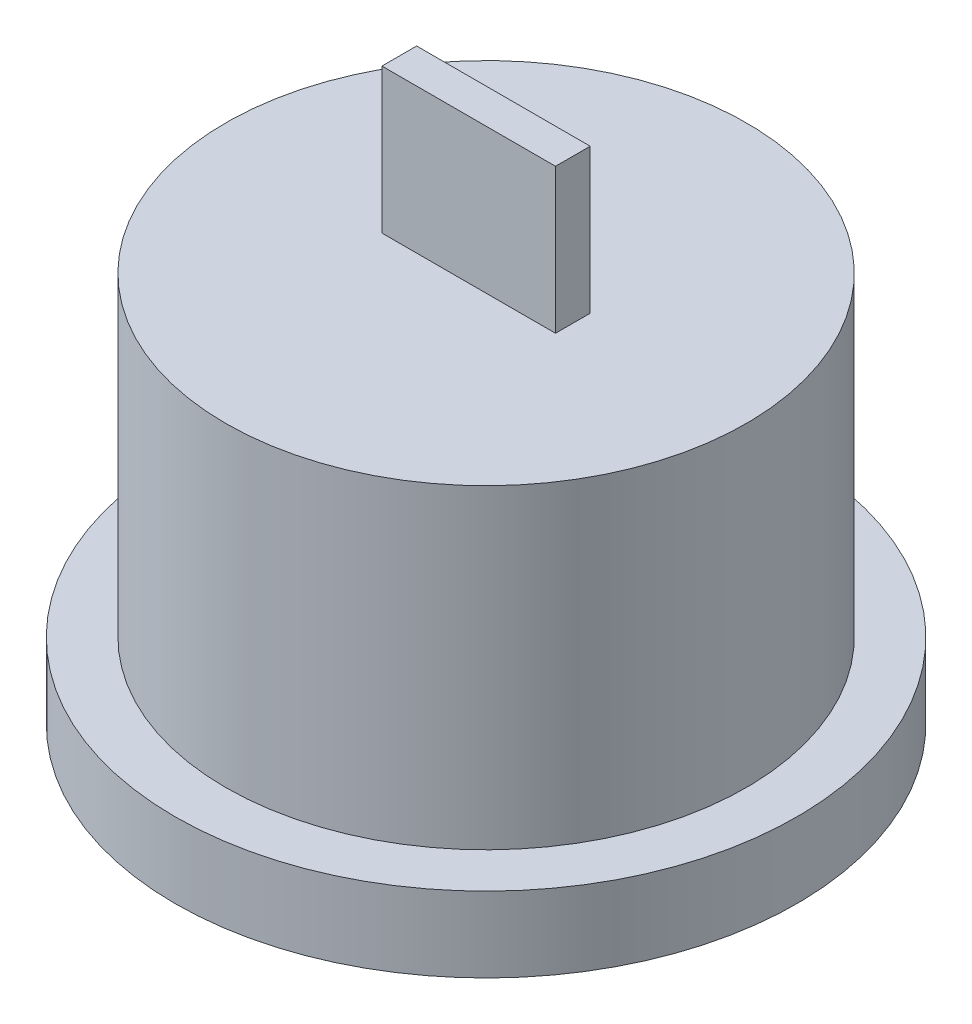
ISO-10303-21;
HEADER;
FILE_DESCRIPTION(('STEP AP214'),'2;1');
FILE_NAME('part.step','',(''),(''),'','','');
FILE_SCHEMA(('AUTOMOTIVE_DESIGN { 1 0 10303 214 1 1 1 1 }'));
ENDSEC;
DATA;
#1=APPLICATION_CONTEXT('core data for automotive mechanical design processes');
#2=APPLICATION_PROTOCOL_DEFINITION('international standard','automotive_design',2000,#1);
#3=PRODUCT_CONTEXT('',#1,'mechanical');
#4=PRODUCT('Part','Part','',(#3));
#5=PRODUCT_RELATED_PRODUCT_CATEGORY('part','',(#4));
#6=PRODUCT_DEFINITION_FORMATION('','',#4);
#7=PRODUCT_DEFINITION_CONTEXT('part definition',#1,'design');
#8=PRODUCT_DEFINITION('design','',#6,#7);
#9=PRODUCT_DEFINITION_SHAPE('','',#8);
#10=(LENGTH_UNIT() NAMED_UNIT(*) SI_UNIT(.MILLI.,.METRE.));
#11=(NAMED_UNIT(*) PLANE_ANGLE_UNIT() SI_UNIT($,.RADIAN.));
#12=(NAMED_UNIT(*) SI_UNIT($,.STERADIAN.) SOLID_ANGLE_UNIT());
#13=UNCERTAINTY_MEASURE_WITH_UNIT(LENGTH_MEASURE(1.E-05),#10,'distance_accuracy_value','');
#14=(GEOMETRIC_REPRESENTATION_CONTEXT(3) GLOBAL_UNCERTAINTY_ASSIGNED_CONTEXT((#13)) GLOBAL_UNIT_ASSIGNED_CONTEXT((#10,
#11,#12)) REPRESENTATION_CONTEXT('',''));
#15=CARTESIAN_POINT('',(0.,0.,0.));
#16=DIRECTION('',(0.,0.,1.));
#17=DIRECTION('',(1.,0.,0.));
#18=AXIS2_PLACEMENT_3D('',#15,#16,#17);
#19=CARTESIAN_POINT('',(0.,2.,0.));
#20=DIRECTION('',(0.,-1.,0.));
#21=DIRECTION('',(0.,0.,-1.));
#22=AXIS2_PLACEMENT_3D('',#19,#20,#21);
#23=PLANE('',#22);
#24=CARTESIAN_POINT('',(0.,2.,0.));
#25=DIRECTION('',(0.,-1.,0.));
#26=DIRECTION('',(0.,0.,-1.));
#27=AXIS2_PLACEMENT_3D('',#24,#25,#26);
#28=CIRCLE('',#27,9.);
#29=CARTESIAN_POINT('',(0.,2.,-9.));
#30=VERTEX_POINT('',#29);
#31=EDGE_CURVE('E168',#30,#30,#28,.T.);
#32=ORIENTED_EDGE('',*,*,#31,.T.);
#33=EDGE_LOOP('',(#32));
#34=FACE_BOUND('',#33,.T.);
#35=DIRECTION('',(0.,0.,-1.));
#36=VECTOR('',#35,1.);
#37=CARTESIAN_POINT('',(3.,2.,0.));
#38=LINE('',#37,#36);
#39=CARTESIAN_POINT('',(3.,2.,0.9));
#40=VERTEX_POINT('',#39);
#41=CARTESIAN_POINT('',(3.,2.,-0.199999999999999));
#42=VERTEX_POINT('',#41);
#43=EDGE_CURVE('E148',#40,#42,#38,.T.);
#44=ORIENTED_EDGE('',*,*,#43,.T.);
#45=DIRECTION('',(-0.707106781186556,0.,-0.707106781186539));
#46=VECTOR('',#45,1.);
#47=CARTESIAN_POINT('',(1.59999999999996,2.,-1.6));
#48=LINE('',#47,#46);
#49=CARTESIAN_POINT('',(2.29999999999998,2.,-0.9));
#50=VERTEX_POINT('',#49);
#51=EDGE_CURVE('E50',#42,#50,#48,.T.);
#52=ORIENTED_EDGE('',*,*,#51,.T.);
#53=DIRECTION('',(1.,0.,0.));
#54=VECTOR('',#53,1.);
#55=CARTESIAN_POINT('',(0.,2.,-0.9));
#56=LINE('',#55,#54);
#57=CARTESIAN_POINT('',(-2.29999999999998,2.,-0.899999999999999));
#58=VERTEX_POINT('',#57);
#59=EDGE_CURVE('E134',#58,#50,#56,.T.);
#60=ORIENTED_EDGE('',*,*,#59,.F.);
#61=DIRECTION('',(0.707106781186556,0.,-0.707106781186539));
#62=VECTOR('',#61,1.);
#63=CARTESIAN_POINT('',(-1.59999999999996,2.,-1.6));
#64=LINE('',#63,#62);
#65=CARTESIAN_POINT('',(-3.,2.,-0.2));
#66=VERTEX_POINT('',#65);
#67=EDGE_CURVE('E137',#66,#58,#64,.T.);
#68=ORIENTED_EDGE('',*,*,#67,.F.);
#69=DIRECTION('',(0.,0.,-1.));
#70=VECTOR('',#69,1.);
#71=CARTESIAN_POINT('',(-3.,2.,0.));
#72=LINE('',#71,#70);
#73=CARTESIAN_POINT('',(-3.,2.,0.9));
#74=VERTEX_POINT('',#73);
#75=EDGE_CURVE('E153',#74,#66,#72,.T.);
#76=ORIENTED_EDGE('',*,*,#75,.F.);
#77=DIRECTION('',(1.,0.,0.));
#78=VECTOR('',#77,1.);
#79=CARTESIAN_POINT('',(0.,2.,0.9));
#80=LINE('',#79,#78);
#81=EDGE_CURVE('E150',#74,#40,#80,.T.);
#82=ORIENTED_EDGE('',*,*,#81,.T.);
#83=EDGE_LOOP('',(#44,#52,#60,#68,#76,#82));
#84=FACE_BOUND('',#83,.T.);
#85=ADVANCED_FACE('F35',(#34,#84),#23,.T.);
#86=CARTESIAN_POINT('',(0.,13.5,0.));
#87=DIRECTION('',(0.,1.,0.));
#88=DIRECTION('',(0.,0.,1.));
#89=AXIS2_PLACEMENT_3D('',#86,#87,#88);
#90=PLANE('',#89);
#91=CARTESIAN_POINT('',(0.,13.5,0.));
#92=DIRECTION('',(0.,1.,0.));
#93=DIRECTION('',(0.,0.,1.));
#94=AXIS2_PLACEMENT_3D('',#91,#92,#93);
#95=CIRCLE('',#94,9.);
#96=CARTESIAN_POINT('',(0.,13.5,9.));
#97=VERTEX_POINT('',#96);
#98=EDGE_CURVE('E203',#97,#97,#95,.T.);
#99=ORIENTED_EDGE('',*,*,#98,.T.);
#100=EDGE_LOOP('',(#99));
#101=FACE_BOUND('',#100,.T.);
#102=DIRECTION('',(-1.,0.,0.));
#103=VECTOR('',#102,1.);
#104=CARTESIAN_POINT('',(-3.,13.5,-0.6));
#105=LINE('',#104,#103);
#106=CARTESIAN_POINT('',(3.,13.5,-0.6));
#107=VERTEX_POINT('',#106);
#108=CARTESIAN_POINT('',(-3.,13.5,-0.6));
#109=VERTEX_POINT('',#108);
#110=EDGE_CURVE('E187',#107,#109,#105,.T.);
#111=ORIENTED_EDGE('',*,*,#110,.F.);
#112=DIRECTION('',(0.,0.,-1.));
#113=VECTOR('',#112,1.);
#114=CARTESIAN_POINT('',(3.,13.5,-0.6));
#115=LINE('',#114,#113);
#116=CARTESIAN_POINT('',(3.,13.5,0.6));
#117=VERTEX_POINT('',#116);
#118=EDGE_CURVE('E171',#117,#107,#115,.T.);
#119=ORIENTED_EDGE('',*,*,#118,.F.);
#120=DIRECTION('',(1.,0.,0.));
#121=VECTOR('',#120,1.);
#122=CARTESIAN_POINT('',(-3.,13.5,0.6));
#123=LINE('',#122,#121);
#124=CARTESIAN_POINT('',(-3.,13.5,0.6));
#125=VERTEX_POINT('',#124);
#126=EDGE_CURVE('E178',#125,#117,#123,.T.);
#127=ORIENTED_EDGE('',*,*,#126,.F.);
#128=DIRECTION('',(0.,0.,1.));
#129=VECTOR('',#128,1.);
#130=CARTESIAN_POINT('',(-3.,13.5,-0.6));
#131=LINE('',#130,#129);
#132=EDGE_CURVE('E189',#109,#125,#131,.T.);
#133=ORIENTED_EDGE('',*,*,#132,.F.);
#134=EDGE_LOOP('',(#111,#119,#127,#133));
#135=FACE_BOUND('',#134,.T.);
#136=ADVANCED_FACE('F227',(#101,#135),#90,.T.);
#137=CARTESIAN_POINT('',(0.,2.6,0.));
#138=DIRECTION('',(0.,-1.,0.));
#139=DIRECTION('',(0.,0.,-1.));
#140=AXIS2_PLACEMENT_3D('',#137,#138,#139);
#141=CYLINDRICAL_SURFACE('',#140,10.75);
#142=CARTESIAN_POINT('',(0.,2.6,0.));
#143=DIRECTION('',(0.,1.,0.));
#144=DIRECTION('',(0.,0.,1.));
#145=AXIS2_PLACEMENT_3D('',#142,#143,#144);
#146=CIRCLE('',#145,10.75);
#147=CARTESIAN_POINT('',(0.,2.6,10.75));
#148=VERTEX_POINT('',#147);
#149=EDGE_CURVE('E12',#148,#148,#146,.T.);
#150=ORIENTED_EDGE('',*,*,#149,.F.);
#151=EDGE_LOOP('',(#150));
#152=FACE_BOUND('',#151,.T.);
#153=CARTESIAN_POINT('',(0.,0.,0.));
#154=DIRECTION('',(0.,1.,0.));
#155=DIRECTION('',(0.,0.,1.));
#156=AXIS2_PLACEMENT_3D('',#153,#154,#155);
#157=CIRCLE('',#156,10.75);
#158=CARTESIAN_POINT('',(0.,0.,10.75));
#159=VERTEX_POINT('',#158);
#160=EDGE_CURVE('E39',#159,#159,#157,.T.);
#161=ORIENTED_EDGE('',*,*,#160,.T.);
#162=EDGE_LOOP('',(#161));
#163=FACE_BOUND('',#162,.T.);
#164=ADVANCED_FACE('F37',(#152,#163),#141,.T.);
#165=CARTESIAN_POINT('',(0.,2.6,0.));
#166=DIRECTION('',(0.,1.,0.));
#167=DIRECTION('',(0.,0.,1.));
#168=AXIS2_PLACEMENT_3D('',#165,#166,#167);
#169=PLANE('',#168);
#170=CARTESIAN_POINT('',(0.,2.6,0.));
#171=DIRECTION('',(0.,1.,0.));
#172=DIRECTION('',(0.,0.,1.));
#173=AXIS2_PLACEMENT_3D('',#170,#171,#172);
#174=CIRCLE('',#173,9.);
#175=CARTESIAN_POINT('',(0.,2.6,9.));
#176=VERTEX_POINT('',#175);
#177=EDGE_CURVE('E200',#176,#176,#174,.T.);
#178=ORIENTED_EDGE('',*,*,#177,.F.);
#179=EDGE_LOOP('',(#178));
#180=FACE_BOUND('',#179,.T.);
#181=ORIENTED_EDGE('',*,*,#149,.T.);
#182=EDGE_LOOP('',(#181));
#183=FACE_BOUND('',#182,.T.);
#184=ADVANCED_FACE('F214',(#180,#183),#169,.T.);
#185=CARTESIAN_POINT('',(0.,0.,0.));
#186=DIRECTION('',(0.,1.,0.));
#187=DIRECTION('',(0.,0.,1.));
#188=AXIS2_PLACEMENT_3D('',#185,#186,#187);
#189=PLANE('',#188);
#190=CARTESIAN_POINT('',(0.,0.,0.));
#191=DIRECTION('',(0.,-1.,0.));
#192=DIRECTION('',(0.,0.,-1.));
#193=AXIS2_PLACEMENT_3D('',#190,#191,#192);
#194=CIRCLE('',#193,9.);
#195=CARTESIAN_POINT('',(0.,0.,-9.));
#196=VERTEX_POINT('',#195);
#197=EDGE_CURVE('E160',#196,#196,#194,.T.);
#198=ORIENTED_EDGE('',*,*,#197,.F.);
#199=EDGE_LOOP('',(#198));
#200=FACE_BOUND('',#199,.T.);
#201=ORIENTED_EDGE('',*,*,#160,.F.);
#202=EDGE_LOOP('',(#201));
#203=FACE_BOUND('',#202,.T.);
#204=ADVANCED_FACE('F211',(#200,#203),#189,.F.);
#205=CARTESIAN_POINT('',(0.,52.4558441227157,0.));
#206=DIRECTION('',(0.,-1.,0.));
#207=DIRECTION('',(0.,0.,-1.));
#208=AXIS2_PLACEMENT_3D('',#205,#206,#207);
#209=CYLINDRICAL_SURFACE('',#208,9.);
#210=ORIENTED_EDGE('',*,*,#177,.T.);
#211=EDGE_LOOP('',(#210));
#212=FACE_BOUND('',#211,.T.);
#213=ORIENTED_EDGE('',*,*,#98,.F.);
#214=EDGE_LOOP('',(#213));
#215=FACE_BOUND('',#214,.T.);
#216=ADVANCED_FACE('F213',(#212,#215),#209,.T.);
#217=CARTESIAN_POINT('',(3.,18.5,-0.6));
#218=DIRECTION('',(-1.,0.,0.));
#219=DIRECTION('',(0.,0.,1.));
#220=AXIS2_PLACEMENT_3D('',#217,#218,#219);
#221=PLANE('',#220);
#222=ORIENTED_EDGE('',*,*,#118,.T.);
#223=DIRECTION('',(0.,-1.,0.));
#224=VECTOR('',#223,1.);
#225=CARTESIAN_POINT('',(3.,18.5,-0.6));
#226=LINE('',#225,#224);
#227=CARTESIAN_POINT('',(3.,18.5,-0.6));
#228=VERTEX_POINT('',#227);
#229=EDGE_CURVE('E198',#228,#107,#226,.T.);
#230=ORIENTED_EDGE('',*,*,#229,.F.);
#231=DIRECTION('',(0.,0.,-1.));
#232=VECTOR('',#231,1.);
#233=CARTESIAN_POINT('',(3.,18.5,-0.6));
#234=LINE('',#233,#232);
#235=CARTESIAN_POINT('',(3.,18.5,0.6));
#236=VERTEX_POINT('',#235);
#237=EDGE_CURVE('E174',#236,#228,#234,.T.);
#238=ORIENTED_EDGE('',*,*,#237,.F.);
#239=DIRECTION('',(0.,-1.,0.));
#240=VECTOR('',#239,1.);
#241=CARTESIAN_POINT('',(3.,18.5,0.6));
#242=LINE('',#241,#240);
#243=EDGE_CURVE('E184',#236,#117,#242,.T.);
#244=ORIENTED_EDGE('',*,*,#243,.T.);
#245=EDGE_LOOP('',(#222,#230,#238,#244));
#246=FACE_BOUND('',#245,.T.);
#247=ADVANCED_FACE('F220',(#246),#221,.F.);
#248=CARTESIAN_POINT('',(-3.,18.5,-0.6));
#249=DIRECTION('',(0.,0.,1.));
#250=DIRECTION('',(1.,0.,0.));
#251=AXIS2_PLACEMENT_3D('',#248,#249,#250);
#252=PLANE('',#251);
#253=ORIENTED_EDGE('',*,*,#110,.T.);
#254=DIRECTION('',(0.,-1.,0.));
#255=VECTOR('',#254,1.);
#256=CARTESIAN_POINT('',(-3.,18.5,-0.6));
#257=LINE('',#256,#255);
#258=CARTESIAN_POINT('',(-3.,18.5,-0.6));
#259=VERTEX_POINT('',#258);
#260=EDGE_CURVE('E195',#259,#109,#257,.T.);
#261=ORIENTED_EDGE('',*,*,#260,.F.);
#262=DIRECTION('',(-1.,0.,0.));
#263=VECTOR('',#262,1.);
#264=CARTESIAN_POINT('',(-3.,18.5,-0.6));
#265=LINE('',#264,#263);
#266=EDGE_CURVE('E177',#228,#259,#265,.T.);
#267=ORIENTED_EDGE('',*,*,#266,.F.);
#268=ORIENTED_EDGE('',*,*,#229,.T.);
#269=EDGE_LOOP('',(#253,#261,#267,#268));
#270=FACE_BOUND('',#269,.T.);
#271=ADVANCED_FACE('F252',(#270),#252,.F.);
#272=CARTESIAN_POINT('',(-3.,18.5,-0.6));
#273=DIRECTION('',(1.,0.,0.));
#274=DIRECTION('',(0.,0.,-1.));
#275=AXIS2_PLACEMENT_3D('',#272,#273,#274);
#276=PLANE('',#275);
#277=ORIENTED_EDGE('',*,*,#132,.T.);
#278=DIRECTION('',(0.,-1.,0.));
#279=VECTOR('',#278,1.);
#280=CARTESIAN_POINT('',(-3.,18.5,0.6));
#281=LINE('',#280,#279);
#282=CARTESIAN_POINT('',(-3.,18.5,0.6));
#283=VERTEX_POINT('',#282);
#284=EDGE_CURVE('E58',#283,#125,#281,.T.);
#285=ORIENTED_EDGE('',*,*,#284,.F.);
#286=DIRECTION('',(0.,0.,1.));
#287=VECTOR('',#286,1.);
#288=CARTESIAN_POINT('',(-3.,18.5,-0.6));
#289=LINE('',#288,#287);
#290=EDGE_CURVE('E180',#259,#283,#289,.T.);
#291=ORIENTED_EDGE('',*,*,#290,.F.);
#292=ORIENTED_EDGE('',*,*,#260,.T.);
#293=EDGE_LOOP('',(#277,#285,#291,#292));
#294=FACE_BOUND('',#293,.T.);
#295=ADVANCED_FACE('F249',(#294),#276,.F.);
#296=CARTESIAN_POINT('',(-3.,18.5,0.6));
#297=DIRECTION('',(0.,0.,-1.));
#298=DIRECTION('',(-1.,0.,0.));
#299=AXIS2_PLACEMENT_3D('',#296,#297,#298);
#300=PLANE('',#299);
#301=ORIENTED_EDGE('',*,*,#126,.T.);
#302=ORIENTED_EDGE('',*,*,#243,.F.);
#303=DIRECTION('',(1.,0.,0.));
#304=VECTOR('',#303,1.);
#305=CARTESIAN_POINT('',(-3.,18.5,0.6));
#306=LINE('',#305,#304);
#307=EDGE_CURVE('E182',#283,#236,#306,.T.);
#308=ORIENTED_EDGE('',*,*,#307,.F.);
#309=ORIENTED_EDGE('',*,*,#284,.T.);
#310=EDGE_LOOP('',(#301,#302,#308,#309));
#311=FACE_BOUND('',#310,.T.);
#312=ADVANCED_FACE('F245',(#311),#300,.F.);
#313=CARTESIAN_POINT('',(0.,18.5,0.));
#314=DIRECTION('',(0.,1.,0.));
#315=DIRECTION('',(0.,0.,1.));
#316=AXIS2_PLACEMENT_3D('',#313,#314,#315);
#317=PLANE('',#316);
#318=ORIENTED_EDGE('',*,*,#237,.T.);
#319=ORIENTED_EDGE('',*,*,#266,.T.);
#320=ORIENTED_EDGE('',*,*,#290,.T.);
#321=ORIENTED_EDGE('',*,*,#307,.T.);
#322=EDGE_LOOP('',(#318,#319,#320,#321));
#323=FACE_BOUND('',#322,.T.);
#324=ADVANCED_FACE('F241',(#323),#317,.T.);
#325=CARTESIAN_POINT('',(0.,2.,0.));
#326=DIRECTION('',(0.,-1.,0.));
#327=DIRECTION('',(0.,0.,-1.));
#328=AXIS2_PLACEMENT_3D('',#325,#326,#327);
#329=CYLINDRICAL_SURFACE('',#328,9.);
#330=ORIENTED_EDGE('',*,*,#31,.F.);
#331=EDGE_LOOP('',(#330));
#332=FACE_BOUND('',#331,.T.);
#333=ORIENTED_EDGE('',*,*,#197,.T.);
#334=EDGE_LOOP('',(#333));
#335=FACE_BOUND('',#334,.T.);
#336=ADVANCED_FACE('F238',(#332,#335),#329,.F.);
#337=CARTESIAN_POINT('',(1.59999999999996,7.,-1.6));
#338=DIRECTION('',(-0.707106781186539,0.,0.707106781186556));
#339=DIRECTION('',(0.707106781186556,0.,0.707106781186539));
#340=AXIS2_PLACEMENT_3D('',#337,#338,#339);
#341=PLANE('',#340);
#342=ORIENTED_EDGE('',*,*,#51,.F.);
#343=DIRECTION('',(0.,-1.,0.));
#344=VECTOR('',#343,1.);
#345=CARTESIAN_POINT('',(3.,7.,-0.199999999999999));
#346=LINE('',#345,#344);
#347=CARTESIAN_POINT('',(3.,7.,-0.199999999999999));
#348=VERTEX_POINT('',#347);
#349=EDGE_CURVE('E117',#348,#42,#346,.T.);
#350=ORIENTED_EDGE('',*,*,#349,.F.);
#351=DIRECTION('',(-0.707106781186556,0.,-0.707106781186539));
#352=VECTOR('',#351,1.);
#353=CARTESIAN_POINT('',(1.59999999999996,7.,-1.6));
#354=LINE('',#353,#352);
#355=CARTESIAN_POINT('',(2.29999999999998,7.,-0.9));
#356=VERTEX_POINT('',#355);
#357=EDGE_CURVE('E124',#348,#356,#354,.T.);
#358=ORIENTED_EDGE('',*,*,#357,.T.);
#359=DIRECTION('',(0.,-1.,0.));
#360=VECTOR('',#359,1.);
#361=CARTESIAN_POINT('',(2.29999999999998,7.,-0.9));
#362=LINE('',#361,#360);
#363=EDGE_CURVE('E158',#356,#50,#362,.T.);
#364=ORIENTED_EDGE('',*,*,#363,.T.);
#365=EDGE_LOOP('',(#342,#350,#358,#364));
#366=FACE_BOUND('',#365,.T.);
#367=ADVANCED_FACE('F126',(#366),#341,.T.);
#368=CARTESIAN_POINT('',(0.,7.,-0.9));
#369=DIRECTION('',(0.,0.,-1.));
#370=DIRECTION('',(-1.,0.,0.));
#371=AXIS2_PLACEMENT_3D('',#368,#369,#370);
#372=PLANE('',#371);
#373=ORIENTED_EDGE('',*,*,#59,.T.);
#374=ORIENTED_EDGE('',*,*,#363,.F.);
#375=DIRECTION('',(1.,0.,0.));
#376=VECTOR('',#375,1.);
#377=CARTESIAN_POINT('',(0.,7.,-0.9));
#378=LINE('',#377,#376);
#379=CARTESIAN_POINT('',(-2.29999999999998,7.,-0.899999999999999));
#380=VERTEX_POINT('',#379);
#381=EDGE_CURVE('E128',#380,#356,#378,.T.);
#382=ORIENTED_EDGE('',*,*,#381,.F.);
#383=DIRECTION('',(0.,-1.,0.));
#384=VECTOR('',#383,1.);
#385=CARTESIAN_POINT('',(-2.29999999999998,7.,-0.899999999999999));
#386=LINE('',#385,#384);
#387=EDGE_CURVE('E161',#380,#58,#386,.T.);
#388=ORIENTED_EDGE('',*,*,#387,.T.);
#389=EDGE_LOOP('',(#373,#374,#382,#388));
#390=FACE_BOUND('',#389,.T.);
#391=ADVANCED_FACE('F300',(#390),#372,.F.);
#392=CARTESIAN_POINT('',(-1.59999999999996,7.,-1.6));
#393=DIRECTION('',(-0.707106781186539,0.,-0.707106781186556));
#394=DIRECTION('',(-0.707106781186556,0.,0.707106781186539));
#395=AXIS2_PLACEMENT_3D('',#392,#393,#394);
#396=PLANE('',#395);
#397=ORIENTED_EDGE('',*,*,#67,.T.);
#398=ORIENTED_EDGE('',*,*,#387,.F.);
#399=DIRECTION('',(0.707106781186556,0.,-0.707106781186539));
#400=VECTOR('',#399,1.);
#401=CARTESIAN_POINT('',(-1.59999999999996,7.,-1.6));
#402=LINE('',#401,#400);
#403=CARTESIAN_POINT('',(-3.,7.,-0.2));
#404=VERTEX_POINT('',#403);
#405=EDGE_CURVE('E144',#404,#380,#402,.T.);
#406=ORIENTED_EDGE('',*,*,#405,.F.);
#407=DIRECTION('',(0.,-1.,0.));
#408=VECTOR('',#407,1.);
#409=CARTESIAN_POINT('',(-3.,7.,-0.2));
#410=LINE('',#409,#408);
#411=EDGE_CURVE('E163',#404,#66,#410,.T.);
#412=ORIENTED_EDGE('',*,*,#411,.T.);
#413=EDGE_LOOP('',(#397,#398,#406,#412));
#414=FACE_BOUND('',#413,.T.);
#415=ADVANCED_FACE('F306',(#414),#396,.F.);
#416=CARTESIAN_POINT('',(-3.,7.,0.));
#417=DIRECTION('',(-1.,0.,0.));
#418=DIRECTION('',(0.,0.,1.));
#419=AXIS2_PLACEMENT_3D('',#416,#417,#418);
#420=PLANE('',#419);
#421=ORIENTED_EDGE('',*,*,#75,.T.);
#422=ORIENTED_EDGE('',*,*,#411,.F.);
#423=DIRECTION('',(0.,0.,-1.));
#424=VECTOR('',#423,1.);
#425=CARTESIAN_POINT('',(-3.,7.,0.));
#426=LINE('',#425,#424);
#427=CARTESIAN_POINT('',(-3.,7.,0.9));
#428=VERTEX_POINT('',#427);
#429=EDGE_CURVE('E141',#428,#404,#426,.T.);
#430=ORIENTED_EDGE('',*,*,#429,.F.);
#431=DIRECTION('',(0.,-1.,0.));
#432=VECTOR('',#431,1.);
#433=CARTESIAN_POINT('',(-3.,7.,0.9));
#434=LINE('',#433,#432);
#435=EDGE_CURVE('E165',#428,#74,#434,.T.);
#436=ORIENTED_EDGE('',*,*,#435,.T.);
#437=EDGE_LOOP('',(#421,#422,#430,#436));
#438=FACE_BOUND('',#437,.T.);
#439=ADVANCED_FACE('F314',(#438),#420,.F.);
#440=CARTESIAN_POINT('',(0.,7.,0.9));
#441=DIRECTION('',(0.,0.,-1.));
#442=DIRECTION('',(-1.,0.,0.));
#443=AXIS2_PLACEMENT_3D('',#440,#441,#442);
#444=PLANE('',#443);
#445=ORIENTED_EDGE('',*,*,#81,.F.);
#446=ORIENTED_EDGE('',*,*,#435,.F.);
#447=DIRECTION('',(1.,0.,0.));
#448=VECTOR('',#447,1.);
#449=CARTESIAN_POINT('',(0.,7.,0.9));
#450=LINE('',#449,#448);
#451=CARTESIAN_POINT('',(3.,7.,0.9));
#452=VERTEX_POINT('',#451);
#453=EDGE_CURVE('E123',#428,#452,#450,.T.);
#454=ORIENTED_EDGE('',*,*,#453,.T.);
#455=DIRECTION('',(0.,-1.,0.));
#456=VECTOR('',#455,1.);
#457=CARTESIAN_POINT('',(3.,7.,0.9));
#458=LINE('',#457,#456);
#459=EDGE_CURVE('E119',#452,#40,#458,.T.);
#460=ORIENTED_EDGE('',*,*,#459,.T.);
#461=EDGE_LOOP('',(#445,#446,#454,#460));
#462=FACE_BOUND('',#461,.T.);
#463=ADVANCED_FACE('F322',(#462),#444,.T.);
#464=CARTESIAN_POINT('',(3.,7.,0.));
#465=DIRECTION('',(-1.,0.,0.));
#466=DIRECTION('',(0.,0.,1.));
#467=AXIS2_PLACEMENT_3D('',#464,#465,#466);
#468=PLANE('',#467);
#469=ORIENTED_EDGE('',*,*,#43,.F.);
#470=ORIENTED_EDGE('',*,*,#459,.F.);
#471=DIRECTION('',(0.,0.,-1.));
#472=VECTOR('',#471,1.);
#473=CARTESIAN_POINT('',(3.,7.,0.));
#474=LINE('',#473,#472);
#475=EDGE_CURVE('E114',#452,#348,#474,.T.);
#476=ORIENTED_EDGE('',*,*,#475,.T.);
#477=ORIENTED_EDGE('',*,*,#349,.T.);
#478=EDGE_LOOP('',(#469,#470,#476,#477));
#479=FACE_BOUND('',#478,.T.);
#480=ADVANCED_FACE('F116',(#479),#468,.T.);
#481=CARTESIAN_POINT('',(0.,7.,0.));
#482=DIRECTION('',(0.,-1.,0.));
#483=DIRECTION('',(0.,0.,-1.));
#484=AXIS2_PLACEMENT_3D('',#481,#482,#483);
#485=PLANE('',#484);
#486=ORIENTED_EDGE('',*,*,#357,.F.);
#487=ORIENTED_EDGE('',*,*,#475,.F.);
#488=ORIENTED_EDGE('',*,*,#453,.F.);
#489=ORIENTED_EDGE('',*,*,#429,.T.);
#490=ORIENTED_EDGE('',*,*,#405,.T.);
#491=ORIENTED_EDGE('',*,*,#381,.T.);
#492=EDGE_LOOP('',(#486,#487,#488,#489,#490,#491));
#493=FACE_BOUND('',#492,.T.);
#494=ADVANCED_FACE('F131',(#493),#485,.T.);
#495=CLOSED_SHELL('',(#85,#136,#164,#184,#204,#216,#247,#271,#295,#312,#324,#336,#367,#391,#415,
#439,#463,#480,#494));
#496=MANIFOLD_SOLID_BREP('B2',#495);
#497=ADVANCED_BREP_SHAPE_REPRESENTATION('',(#18,#496),#14);
#498=SHAPE_DEFINITION_REPRESENTATION(#9,#497);
ENDSEC;
END-ISO-10303-21;
